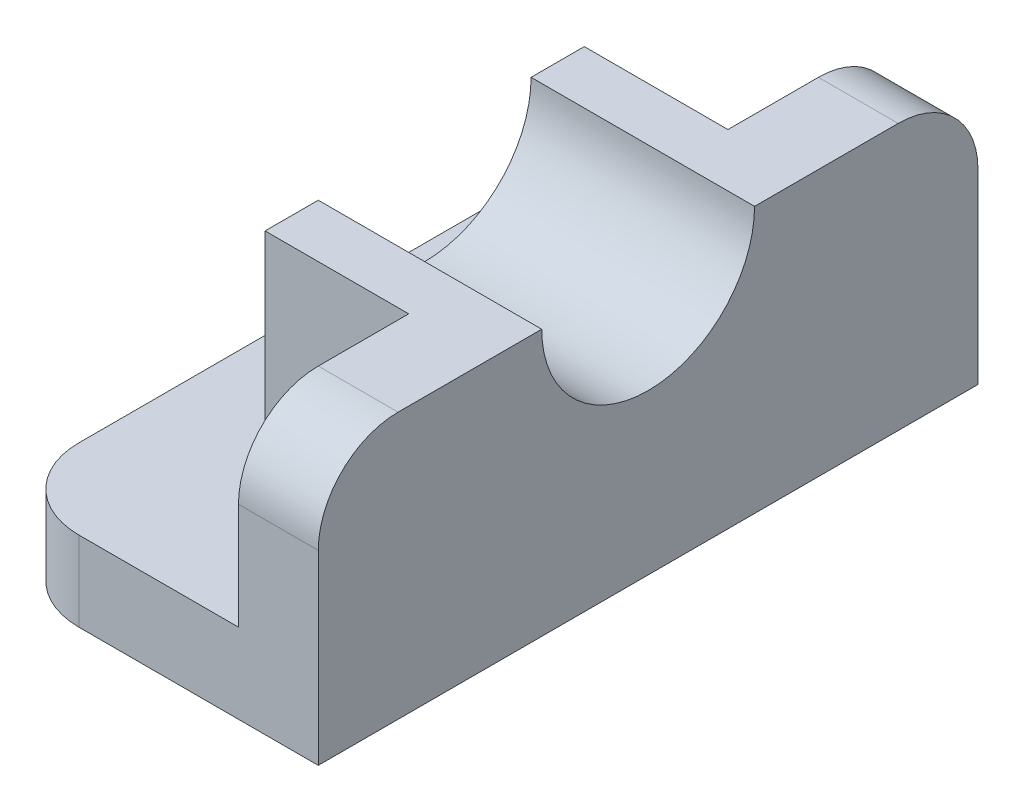
ISO-10303-21;
HEADER;
FILE_DESCRIPTION(('STEP AP214'),'2;1');
FILE_NAME('part.step','',(''),(''),'','','');
FILE_SCHEMA(('AUTOMOTIVE_DESIGN { 1 0 10303 214 1 1 1 1 }'));
ENDSEC;
DATA;
#1=APPLICATION_CONTEXT('core data for automotive mechanical design processes');
#2=APPLICATION_PROTOCOL_DEFINITION('international standard','automotive_design',2000,#1);
#3=PRODUCT_CONTEXT('',#1,'mechanical');
#4=PRODUCT('Part','Part','',(#3));
#5=PRODUCT_RELATED_PRODUCT_CATEGORY('part','',(#4));
#6=PRODUCT_DEFINITION_FORMATION('','',#4);
#7=PRODUCT_DEFINITION_CONTEXT('part definition',#1,'design');
#8=PRODUCT_DEFINITION('design','',#6,#7);
#9=PRODUCT_DEFINITION_SHAPE('','',#8);
#10=(LENGTH_UNIT() NAMED_UNIT(*) SI_UNIT(.MILLI.,.METRE.));
#11=(NAMED_UNIT(*) PLANE_ANGLE_UNIT() SI_UNIT($,.RADIAN.));
#12=(NAMED_UNIT(*) SI_UNIT($,.STERADIAN.) SOLID_ANGLE_UNIT());
#13=UNCERTAINTY_MEASURE_WITH_UNIT(LENGTH_MEASURE(1.E-05),#10,'distance_accuracy_value','');
#14=(GEOMETRIC_REPRESENTATION_CONTEXT(3) GLOBAL_UNCERTAINTY_ASSIGNED_CONTEXT((#13)) GLOBAL_UNIT_ASSIGNED_CONTEXT((#10,
#11,#12)) REPRESENTATION_CONTEXT('',''));
#15=CARTESIAN_POINT('',(0.,0.,0.));
#16=DIRECTION('',(0.,0.,1.));
#17=DIRECTION('',(1.,0.,0.));
#18=AXIS2_PLACEMENT_3D('',#15,#16,#17);
#19=CARTESIAN_POINT('',(60.,50.,124.));
#20=DIRECTION('',(0.,-1.,0.));
#21=DIRECTION('',(1.,0.,0.));
#22=AXIS2_PLACEMENT_3D('',#19,#20,#21);
#23=PLANE('',#22);
#24=DIRECTION('',(0.,0.,-1.));
#25=VECTOR('',#24,1.);
#26=CARTESIAN_POINT('',(60.,50.,124.));
#27=LINE('',#26,#25);
#28=CARTESIAN_POINT('',(60.,50.,109.));
#29=VERTEX_POINT('',#28);
#30=CARTESIAN_POINT('',(60.,50.,82.));
#31=VERTEX_POINT('',#30);
#32=EDGE_CURVE('E167',#29,#31,#27,.T.);
#33=ORIENTED_EDGE('',*,*,#32,.T.);
#34=DIRECTION('',(-1.,0.,0.));
#35=VECTOR('',#34,1.);
#36=CARTESIAN_POINT('',(68.,50.,82.));
#37=LINE('',#36,#35);
#38=CARTESIAN_POINT('',(18.,50.,82.));
#39=VERTEX_POINT('',#38);
#40=EDGE_CURVE('E156',#31,#39,#37,.T.);
#41=ORIENTED_EDGE('',*,*,#40,.T.);
#42=DIRECTION('',(0.,0.,-1.));
#43=VECTOR('',#42,1.);
#44=CARTESIAN_POINT('',(18.,50.,32.));
#45=LINE('',#44,#43);
#46=CARTESIAN_POINT('',(18.,50.,92.));
#47=VERTEX_POINT('',#46);
#48=EDGE_CURVE('E165',#47,#39,#45,.T.);
#49=ORIENTED_EDGE('',*,*,#48,.F.);
#50=DIRECTION('',(1.,0.,0.));
#51=VECTOR('',#50,1.);
#52=CARTESIAN_POINT('',(18.,50.,92.));
#53=LINE('',#52,#51);
#54=CARTESIAN_POINT('',(45.,50.,92.));
#55=VERTEX_POINT('',#54);
#56=EDGE_CURVE('E182',#47,#55,#53,.T.);
#57=ORIENTED_EDGE('',*,*,#56,.T.);
#58=DIRECTION('',(0.,0.,-1.));
#59=VECTOR('',#58,1.);
#60=CARTESIAN_POINT('',(45.,50.,124.));
#61=LINE('',#60,#59);
#62=CARTESIAN_POINT('',(45.,50.,109.));
#63=VERTEX_POINT('',#62);
#64=EDGE_CURVE('E239',#63,#55,#61,.T.);
#65=ORIENTED_EDGE('',*,*,#64,.F.);
#66=DIRECTION('',(-1.,0.,0.));
#67=VECTOR('',#66,1.);
#68=CARTESIAN_POINT('',(60.,50.,109.));
#69=LINE('',#68,#67);
#70=EDGE_CURVE('E254',#63,#29,#69,.F.);
#71=ORIENTED_EDGE('',*,*,#70,.T.);
#72=EDGE_LOOP('',(#33,#41,#49,#57,#65,#71));
#73=FACE_BOUND('',#72,.T.);
#74=ADVANCED_FACE('F43',(#73),#23,.F.);
#75=CARTESIAN_POINT('',(45.,50.,124.));
#76=DIRECTION('',(1.,0.,0.));
#77=DIRECTION('',(0.,0.,-1.));
#78=AXIS2_PLACEMENT_3D('',#75,#76,#77);
#79=PLANE('',#78);
#80=DIRECTION('',(0.,-1.,0.));
#81=VECTOR('',#80,1.);
#82=CARTESIAN_POINT('',(45.,50.,32.));
#83=LINE('',#82,#81);
#84=CARTESIAN_POINT('',(45.,50.,32.));
#85=VERTEX_POINT('',#84);
#86=CARTESIAN_POINT('',(45.,15.,32.));
#87=VERTEX_POINT('',#86);
#88=EDGE_CURVE('E169',#85,#87,#83,.T.);
#89=ORIENTED_EDGE('',*,*,#88,.F.);
#90=CARTESIAN_POINT('',(45.,50.,15.));
#91=VERTEX_POINT('',#90);
#92=EDGE_CURVE('E238',#85,#91,#61,.T.);
#93=ORIENTED_EDGE('',*,*,#92,.T.);
#94=CARTESIAN_POINT('',(45.,35.,15.));
#95=DIRECTION('',(1.,0.,0.));
#96=DIRECTION('',(0.,0.,-1.));
#97=AXIS2_PLACEMENT_3D('',#94,#95,#96);
#98=CIRCLE('',#97,15.);
#99=CARTESIAN_POINT('',(45.,35.,0.));
#100=VERTEX_POINT('',#99);
#101=EDGE_CURVE('E264',#91,#100,#98,.F.);
#102=ORIENTED_EDGE('',*,*,#101,.T.);
#103=DIRECTION('',(0.,-1.,0.));
#104=VECTOR('',#103,1.);
#105=CARTESIAN_POINT('',(45.,50.,0.));
#106=LINE('',#105,#104);
#107=CARTESIAN_POINT('',(45.,15.,0.));
#108=VERTEX_POINT('',#107);
#109=EDGE_CURVE('E223',#100,#108,#106,.T.);
#110=ORIENTED_EDGE('',*,*,#109,.T.);
#111=DIRECTION('',(0.,0.,-1.));
#112=VECTOR('',#111,1.);
#113=CARTESIAN_POINT('',(45.,15.,124.));
#114=LINE('',#113,#112);
#115=EDGE_CURVE('E233',#87,#108,#114,.T.);
#116=ORIENTED_EDGE('',*,*,#115,.F.);
#117=EDGE_LOOP('',(#89,#93,#102,#110,#116));
#118=FACE_BOUND('',#117,.T.);
#119=ADVANCED_FACE('F346',(#118),#79,.F.);
#120=DIRECTION('',(0.,1.,0.));
#121=VECTOR('',#120,1.);
#122=CARTESIAN_POINT('',(45.,50.,92.));
#123=LINE('',#122,#121);
#124=CARTESIAN_POINT('',(45.,15.,92.));
#125=VERTEX_POINT('',#124);
#126=EDGE_CURVE('E189',#125,#55,#123,.T.);
#127=ORIENTED_EDGE('',*,*,#126,.F.);
#128=CARTESIAN_POINT('',(45.,15.,124.));
#129=VERTEX_POINT('',#128);
#130=EDGE_CURVE('E234',#129,#125,#114,.T.);
#131=ORIENTED_EDGE('',*,*,#130,.F.);
#132=DIRECTION('',(0.,-1.,0.));
#133=VECTOR('',#132,1.);
#134=CARTESIAN_POINT('',(45.,50.,124.));
#135=LINE('',#134,#133);
#136=CARTESIAN_POINT('',(45.,35.,124.));
#137=VERTEX_POINT('',#136);
#138=EDGE_CURVE('E209',#137,#129,#135,.T.);
#139=ORIENTED_EDGE('',*,*,#138,.F.);
#140=CARTESIAN_POINT('',(45.,35.,109.));
#141=DIRECTION('',(1.,0.,0.));
#142=DIRECTION('',(0.,0.,-1.));
#143=AXIS2_PLACEMENT_3D('',#140,#141,#142);
#144=CIRCLE('',#143,15.);
#145=EDGE_CURVE('E261',#137,#63,#144,.F.);
#146=ORIENTED_EDGE('',*,*,#145,.T.);
#147=ORIENTED_EDGE('',*,*,#64,.T.);
#148=EDGE_LOOP('',(#127,#131,#139,#146,#147));
#149=FACE_BOUND('',#148,.T.);
#150=ADVANCED_FACE('F369',(#149),#79,.F.);
#151=CARTESIAN_POINT('',(45.,15.,124.));
#152=DIRECTION('',(0.,-1.,0.));
#153=DIRECTION('',(1.,0.,0.));
#154=AXIS2_PLACEMENT_3D('',#151,#152,#153);
#155=PLANE('',#154);
#156=DIRECTION('',(1.,0.,0.));
#157=VECTOR('',#156,1.);
#158=CARTESIAN_POINT('',(18.,15.,32.));
#159=LINE('',#158,#157);
#160=CARTESIAN_POINT('',(18.,15.,32.));
#161=VERTEX_POINT('',#160);
#162=EDGE_CURVE('E66',#161,#87,#159,.T.);
#163=ORIENTED_EDGE('',*,*,#162,.T.);
#164=ORIENTED_EDGE('',*,*,#115,.T.);
#165=DIRECTION('',(-1.,0.,0.));
#166=VECTOR('',#165,1.);
#167=CARTESIAN_POINT('',(45.,15.,0.));
#168=LINE('',#167,#166);
#169=CARTESIAN_POINT('',(15.,15.,0.));
#170=VERTEX_POINT('',#169);
#171=EDGE_CURVE('E205',#108,#170,#168,.T.);
#172=ORIENTED_EDGE('',*,*,#171,.T.);
#173=CARTESIAN_POINT('',(15.,15.,15.));
#174=DIRECTION('',(0.,-1.,0.));
#175=DIRECTION('',(1.,0.,0.));
#176=AXIS2_PLACEMENT_3D('',#173,#174,#175);
#177=CIRCLE('',#176,15.);
#178=CARTESIAN_POINT('',(0.,15.,15.));
#179=VERTEX_POINT('',#178);
#180=EDGE_CURVE('E52',#170,#179,#177,.F.);
#181=ORIENTED_EDGE('',*,*,#180,.T.);
#182=DIRECTION('',(0.,0.,-1.));
#183=VECTOR('',#182,1.);
#184=CARTESIAN_POINT('',(0.,15.,124.));
#185=LINE('',#184,#183);
#186=CARTESIAN_POINT('',(0.,15.,109.));
#187=VERTEX_POINT('',#186);
#188=EDGE_CURVE('E216',#187,#179,#185,.T.);
#189=ORIENTED_EDGE('',*,*,#188,.F.);
#190=CARTESIAN_POINT('',(15.,15.,109.));
#191=DIRECTION('',(0.,-1.,0.));
#192=DIRECTION('',(1.,0.,0.));
#193=AXIS2_PLACEMENT_3D('',#190,#191,#192);
#194=CIRCLE('',#193,15.);
#195=CARTESIAN_POINT('',(15.,15.,124.));
#196=VERTEX_POINT('',#195);
#197=EDGE_CURVE('E291',#187,#196,#194,.F.);
#198=ORIENTED_EDGE('',*,*,#197,.T.);
#199=DIRECTION('',(-1.,0.,0.));
#200=VECTOR('',#199,1.);
#201=CARTESIAN_POINT('',(45.,15.,124.));
#202=LINE('',#201,#200);
#203=EDGE_CURVE('E212',#129,#196,#202,.T.);
#204=ORIENTED_EDGE('',*,*,#203,.F.);
#205=ORIENTED_EDGE('',*,*,#130,.T.);
#206=DIRECTION('',(1.,0.,0.));
#207=VECTOR('',#206,1.);
#208=CARTESIAN_POINT('',(18.,15.,92.));
#209=LINE('',#208,#207);
#210=CARTESIAN_POINT('',(18.,15.,92.));
#211=VERTEX_POINT('',#210);
#212=EDGE_CURVE('E195',#211,#125,#209,.T.);
#213=ORIENTED_EDGE('',*,*,#212,.F.);
#214=DIRECTION('',(0.,0.,1.));
#215=VECTOR('',#214,1.);
#216=CARTESIAN_POINT('',(18.,15.,32.));
#217=LINE('',#216,#215);
#218=EDGE_CURVE('E348',#161,#211,#217,.T.);
#219=ORIENTED_EDGE('',*,*,#218,.F.);
#220=EDGE_LOOP('',(#163,#164,#172,#181,#189,#198,#204,#205,#213,#219));
#221=FACE_BOUND('',#220,.T.);
#222=ADVANCED_FACE('F307',(#221),#155,.F.);
#223=CARTESIAN_POINT('',(0.,15.,124.));
#224=DIRECTION('',(1.,0.,0.));
#225=DIRECTION('',(0.,1.,0.));
#226=AXIS2_PLACEMENT_3D('',#223,#224,#225);
#227=PLANE('',#226);
#228=ORIENTED_EDGE('',*,*,#188,.T.);
#229=DIRECTION('',(0.,-1.,0.));
#230=VECTOR('',#229,1.);
#231=CARTESIAN_POINT('',(0.,15.,15.));
#232=LINE('',#231,#230);
#233=CARTESIAN_POINT('',(0.,0.,15.));
#234=VERTEX_POINT('',#233);
#235=EDGE_CURVE('E294',#179,#234,#232,.T.);
#236=ORIENTED_EDGE('',*,*,#235,.T.);
#237=DIRECTION('',(0.,0.,-1.));
#238=VECTOR('',#237,1.);
#239=CARTESIAN_POINT('',(0.,0.,124.));
#240=LINE('',#239,#238);
#241=CARTESIAN_POINT('',(0.,0.,109.));
#242=VERTEX_POINT('',#241);
#243=EDGE_CURVE('E250',#242,#234,#240,.T.);
#244=ORIENTED_EDGE('',*,*,#243,.F.);
#245=DIRECTION('',(0.,-1.,0.));
#246=VECTOR('',#245,1.);
#247=CARTESIAN_POINT('',(0.,15.,109.));
#248=LINE('',#247,#246);
#249=EDGE_CURVE('E288',#242,#187,#248,.F.);
#250=ORIENTED_EDGE('',*,*,#249,.T.);
#251=EDGE_LOOP('',(#228,#236,#244,#250));
#252=FACE_BOUND('',#251,.T.);
#253=ADVANCED_FACE('F314',(#252),#227,.F.);
#254=CARTESIAN_POINT('',(0.,0.,124.));
#255=DIRECTION('',(0.,1.,0.));
#256=DIRECTION('',(0.,0.,1.));
#257=AXIS2_PLACEMENT_3D('',#254,#255,#256);
#258=PLANE('',#257);
#259=ORIENTED_EDGE('',*,*,#243,.T.);
#260=CARTESIAN_POINT('',(15.,0.,15.));
#261=DIRECTION('',(0.,1.,0.));
#262=DIRECTION('',(0.,0.,1.));
#263=AXIS2_PLACEMENT_3D('',#260,#261,#262);
#264=CIRCLE('',#263,15.);
#265=CARTESIAN_POINT('',(15.,0.,0.));
#266=VERTEX_POINT('',#265);
#267=EDGE_CURVE('E298',#234,#266,#264,.F.);
#268=ORIENTED_EDGE('',*,*,#267,.T.);
#269=DIRECTION('',(1.,0.,0.));
#270=VECTOR('',#269,1.);
#271=CARTESIAN_POINT('',(0.,0.,0.));
#272=LINE('',#271,#270);
#273=CARTESIAN_POINT('',(60.,0.,0.));
#274=VERTEX_POINT('',#273);
#275=EDGE_CURVE('E200',#266,#274,#272,.T.);
#276=ORIENTED_EDGE('',*,*,#275,.T.);
#277=DIRECTION('',(0.,0.,-1.));
#278=VECTOR('',#277,1.);
#279=CARTESIAN_POINT('',(60.,0.,124.));
#280=LINE('',#279,#278);
#281=CARTESIAN_POINT('',(60.,0.,124.));
#282=VERTEX_POINT('',#281);
#283=EDGE_CURVE('E246',#282,#274,#280,.T.);
#284=ORIENTED_EDGE('',*,*,#283,.F.);
#285=DIRECTION('',(1.,0.,0.));
#286=VECTOR('',#285,1.);
#287=CARTESIAN_POINT('',(0.,0.,124.));
#288=LINE('',#287,#286);
#289=CARTESIAN_POINT('',(15.,0.,124.));
#290=VERTEX_POINT('',#289);
#291=EDGE_CURVE('E201',#290,#282,#288,.T.);
#292=ORIENTED_EDGE('',*,*,#291,.F.);
#293=CARTESIAN_POINT('',(15.,0.,109.));
#294=DIRECTION('',(0.,1.,0.));
#295=DIRECTION('',(0.,0.,1.));
#296=AXIS2_PLACEMENT_3D('',#293,#294,#295);
#297=CIRCLE('',#296,15.);
#298=EDGE_CURVE('E285',#290,#242,#297,.F.);
#299=ORIENTED_EDGE('',*,*,#298,.T.);
#300=EDGE_LOOP('',(#259,#268,#276,#284,#292,#299));
#301=FACE_BOUND('',#300,.T.);
#302=ADVANCED_FACE('F319',(#301),#258,.F.);
#303=CARTESIAN_POINT('',(60.,0.,124.));
#304=DIRECTION('',(-1.,0.,0.));
#305=DIRECTION('',(0.,0.,1.));
#306=AXIS2_PLACEMENT_3D('',#303,#304,#305);
#307=PLANE('',#306);
#308=CARTESIAN_POINT('',(60.,50.,42.));
#309=VERTEX_POINT('',#308);
#310=CARTESIAN_POINT('',(60.,50.,15.));
#311=VERTEX_POINT('',#310);
#312=EDGE_CURVE('E243',#309,#311,#27,.T.);
#313=ORIENTED_EDGE('',*,*,#312,.F.);
#314=CARTESIAN_POINT('',(60.,50.,62.));
#315=DIRECTION('',(-1.,0.,0.));
#316=DIRECTION('',(0.,0.,1.));
#317=AXIS2_PLACEMENT_3D('',#314,#315,#316);
#318=CIRCLE('',#317,20.);
#319=EDGE_CURVE('E170',#309,#31,#318,.T.);
#320=ORIENTED_EDGE('',*,*,#319,.T.);
#321=ORIENTED_EDGE('',*,*,#32,.F.);
#322=CARTESIAN_POINT('',(60.,35.,109.));
#323=DIRECTION('',(-1.,0.,0.));
#324=DIRECTION('',(0.,0.,1.));
#325=AXIS2_PLACEMENT_3D('',#322,#323,#324);
#326=CIRCLE('',#325,15.);
#327=CARTESIAN_POINT('',(60.,35.,124.));
#328=VERTEX_POINT('',#327);
#329=EDGE_CURVE('E270',#29,#328,#326,.F.);
#330=ORIENTED_EDGE('',*,*,#329,.T.);
#331=DIRECTION('',(0.,1.,0.));
#332=VECTOR('',#331,1.);
#333=CARTESIAN_POINT('',(60.,0.,124.));
#334=LINE('',#333,#332);
#335=EDGE_CURVE('E204',#282,#328,#334,.T.);
#336=ORIENTED_EDGE('',*,*,#335,.F.);
#337=ORIENTED_EDGE('',*,*,#283,.T.);
#338=DIRECTION('',(0.,1.,0.));
#339=VECTOR('',#338,1.);
#340=CARTESIAN_POINT('',(60.,0.,0.));
#341=LINE('',#340,#339);
#342=CARTESIAN_POINT('',(60.,35.,0.));
#343=VERTEX_POINT('',#342);
#344=EDGE_CURVE('E219',#274,#343,#341,.T.);
#345=ORIENTED_EDGE('',*,*,#344,.T.);
#346=CARTESIAN_POINT('',(60.,35.,15.));
#347=DIRECTION('',(-1.,0.,0.));
#348=DIRECTION('',(0.,0.,1.));
#349=AXIS2_PLACEMENT_3D('',#346,#347,#348);
#350=CIRCLE('',#349,15.);
#351=EDGE_CURVE('E273',#343,#311,#350,.F.);
#352=ORIENTED_EDGE('',*,*,#351,.T.);
#353=EDGE_LOOP('',(#313,#320,#321,#330,#336,#337,#345,#352));
#354=FACE_BOUND('',#353,.T.);
#355=ADVANCED_FACE('F329',(#354),#307,.F.);
#356=CARTESIAN_POINT('',(18.,50.,42.));
#357=VERTEX_POINT('',#356);
#358=CARTESIAN_POINT('',(18.,50.,32.));
#359=VERTEX_POINT('',#358);
#360=EDGE_CURVE('E178',#357,#359,#45,.T.);
#361=ORIENTED_EDGE('',*,*,#360,.F.);
#362=DIRECTION('',(-1.,0.,0.));
#363=VECTOR('',#362,1.);
#364=CARTESIAN_POINT('',(68.,50.,42.));
#365=LINE('',#364,#363);
#366=EDGE_CURVE('E58',#357,#309,#365,.F.);
#367=ORIENTED_EDGE('',*,*,#366,.T.);
#368=ORIENTED_EDGE('',*,*,#312,.T.);
#369=DIRECTION('',(-1.,0.,0.));
#370=VECTOR('',#369,1.);
#371=CARTESIAN_POINT('',(60.,50.,15.));
#372=LINE('',#371,#370);
#373=EDGE_CURVE('E257',#311,#91,#372,.T.);
#374=ORIENTED_EDGE('',*,*,#373,.T.);
#375=ORIENTED_EDGE('',*,*,#92,.F.);
#376=DIRECTION('',(1.,0.,0.));
#377=VECTOR('',#376,1.);
#378=CARTESIAN_POINT('',(18.,50.,32.));
#379=LINE('',#378,#377);
#380=EDGE_CURVE('E177',#359,#85,#379,.T.);
#381=ORIENTED_EDGE('',*,*,#380,.F.);
#382=EDGE_LOOP('',(#361,#367,#368,#374,#375,#381));
#383=FACE_BOUND('',#382,.T.);
#384=ADVANCED_FACE('F337',(#383),#23,.F.);
#385=CARTESIAN_POINT('',(0.,0.,124.));
#386=DIRECTION('',(0.,0.,1.));
#387=DIRECTION('',(1.,0.,0.));
#388=AXIS2_PLACEMENT_3D('',#385,#386,#387);
#389=PLANE('',#388);
#390=ORIENTED_EDGE('',*,*,#203,.T.);
#391=DIRECTION('',(0.,-1.,0.));
#392=VECTOR('',#391,1.);
#393=CARTESIAN_POINT('',(15.,0.,124.));
#394=LINE('',#393,#392);
#395=EDGE_CURVE('E281',#196,#290,#394,.T.);
#396=ORIENTED_EDGE('',*,*,#395,.T.);
#397=ORIENTED_EDGE('',*,*,#291,.T.);
#398=ORIENTED_EDGE('',*,*,#335,.T.);
#399=DIRECTION('',(-1.,0.,0.));
#400=VECTOR('',#399,1.);
#401=CARTESIAN_POINT('',(45.,35.,124.));
#402=LINE('',#401,#400);
#403=EDGE_CURVE('E277',#328,#137,#402,.T.);
#404=ORIENTED_EDGE('',*,*,#403,.T.);
#405=ORIENTED_EDGE('',*,*,#138,.T.);
#406=EDGE_LOOP('',(#390,#396,#397,#398,#404,#405));
#407=FACE_BOUND('',#406,.T.);
#408=ADVANCED_FACE('F365',(#407),#389,.T.);
#409=CARTESIAN_POINT('',(0.,0.,0.));
#410=DIRECTION('',(0.,0.,1.));
#411=DIRECTION('',(1.,0.,0.));
#412=AXIS2_PLACEMENT_3D('',#409,#410,#411);
#413=PLANE('',#412);
#414=ORIENTED_EDGE('',*,*,#275,.F.);
#415=DIRECTION('',(0.,-1.,0.));
#416=VECTOR('',#415,1.);
#417=CARTESIAN_POINT('',(15.,0.,0.));
#418=LINE('',#417,#416);
#419=EDGE_CURVE('E301',#266,#170,#418,.F.);
#420=ORIENTED_EDGE('',*,*,#419,.T.);
#421=ORIENTED_EDGE('',*,*,#171,.F.);
#422=ORIENTED_EDGE('',*,*,#109,.F.);
#423=DIRECTION('',(-1.,0.,0.));
#424=VECTOR('',#423,1.);
#425=CARTESIAN_POINT('',(0.,35.,0.));
#426=LINE('',#425,#424);
#427=EDGE_CURVE('E267',#100,#343,#426,.F.);
#428=ORIENTED_EDGE('',*,*,#427,.T.);
#429=ORIENTED_EDGE('',*,*,#344,.F.);
#430=EDGE_LOOP('',(#414,#420,#421,#422,#428,#429));
#431=FACE_BOUND('',#430,.T.);
#432=ADVANCED_FACE('F323',(#431),#413,.F.);
#433=CARTESIAN_POINT('',(60.,35.,15.));
#434=DIRECTION('',(-1.,0.,0.));
#435=DIRECTION('',(0.,-1.,0.));
#436=AXIS2_PLACEMENT_3D('',#433,#434,#435);
#437=CYLINDRICAL_SURFACE('',#436,15.);
#438=ORIENTED_EDGE('',*,*,#351,.F.);
#439=ORIENTED_EDGE('',*,*,#427,.F.);
#440=ORIENTED_EDGE('',*,*,#101,.F.);
#441=ORIENTED_EDGE('',*,*,#373,.F.);
#442=EDGE_LOOP('',(#438,#439,#440,#441));
#443=FACE_BOUND('',#442,.T.);
#444=ADVANCED_FACE('F333',(#443),#437,.T.);
#445=CARTESIAN_POINT('',(15.,0.,109.));
#446=DIRECTION('',(0.,1.,0.));
#447=DIRECTION('',(-1.,0.,0.));
#448=AXIS2_PLACEMENT_3D('',#445,#446,#447);
#449=CYLINDRICAL_SURFACE('',#448,15.);
#450=ORIENTED_EDGE('',*,*,#197,.F.);
#451=ORIENTED_EDGE('',*,*,#249,.F.);
#452=ORIENTED_EDGE('',*,*,#298,.F.);
#453=ORIENTED_EDGE('',*,*,#395,.F.);
#454=EDGE_LOOP('',(#450,#451,#452,#453));
#455=FACE_BOUND('',#454,.T.);
#456=ADVANCED_FACE('F375',(#455),#449,.T.);
#457=CARTESIAN_POINT('',(0.,35.,109.));
#458=DIRECTION('',(1.,0.,0.));
#459=DIRECTION('',(0.,1.,0.));
#460=AXIS2_PLACEMENT_3D('',#457,#458,#459);
#461=CYLINDRICAL_SURFACE('',#460,15.);
#462=ORIENTED_EDGE('',*,*,#329,.F.);
#463=ORIENTED_EDGE('',*,*,#70,.F.);
#464=ORIENTED_EDGE('',*,*,#145,.F.);
#465=ORIENTED_EDGE('',*,*,#403,.F.);
#466=EDGE_LOOP('',(#462,#463,#464,#465));
#467=FACE_BOUND('',#466,.T.);
#468=ADVANCED_FACE('F362',(#467),#461,.T.);
#469=CARTESIAN_POINT('',(15.,15.,15.));
#470=DIRECTION('',(0.,-1.,0.));
#471=DIRECTION('',(1.,0.,0.));
#472=AXIS2_PLACEMENT_3D('',#469,#470,#471);
#473=CYLINDRICAL_SURFACE('',#472,15.);
#474=ORIENTED_EDGE('',*,*,#180,.F.);
#475=ORIENTED_EDGE('',*,*,#419,.F.);
#476=ORIENTED_EDGE('',*,*,#267,.F.);
#477=ORIENTED_EDGE('',*,*,#235,.F.);
#478=EDGE_LOOP('',(#474,#475,#476,#477));
#479=FACE_BOUND('',#478,.T.);
#480=ADVANCED_FACE('F45',(#479),#473,.T.);
#481=CARTESIAN_POINT('',(18.,50.,32.));
#482=DIRECTION('',(0.,0.,1.));
#483=DIRECTION('',(0.,-1.,0.));
#484=AXIS2_PLACEMENT_3D('',#481,#482,#483);
#485=PLANE('',#484);
#486=ORIENTED_EDGE('',*,*,#88,.T.);
#487=ORIENTED_EDGE('',*,*,#162,.F.);
#488=DIRECTION('',(0.,-1.,0.));
#489=VECTOR('',#488,1.);
#490=CARTESIAN_POINT('',(18.,50.,32.));
#491=LINE('',#490,#489);
#492=EDGE_CURVE('E191',#359,#161,#491,.T.);
#493=ORIENTED_EDGE('',*,*,#492,.F.);
#494=ORIENTED_EDGE('',*,*,#380,.T.);
#495=EDGE_LOOP('',(#486,#487,#493,#494));
#496=FACE_BOUND('',#495,.T.);
#497=ADVANCED_FACE('F347',(#496),#485,.F.);
#498=CARTESIAN_POINT('',(18.,50.,92.));
#499=DIRECTION('',(0.,0.,-1.));
#500=DIRECTION('',(0.,1.,0.));
#501=AXIS2_PLACEMENT_3D('',#498,#499,#500);
#502=PLANE('',#501);
#503=ORIENTED_EDGE('',*,*,#126,.T.);
#504=ORIENTED_EDGE('',*,*,#56,.F.);
#505=DIRECTION('',(0.,1.,0.));
#506=VECTOR('',#505,1.);
#507=CARTESIAN_POINT('',(18.,50.,92.));
#508=LINE('',#507,#506);
#509=EDGE_CURVE('E174',#211,#47,#508,.T.);
#510=ORIENTED_EDGE('',*,*,#509,.F.);
#511=ORIENTED_EDGE('',*,*,#212,.T.);
#512=EDGE_LOOP('',(#503,#504,#510,#511));
#513=FACE_BOUND('',#512,.T.);
#514=ADVANCED_FACE('F414',(#513),#502,.F.);
#515=CARTESIAN_POINT('',(18.,0.,0.));
#516=DIRECTION('',(-1.,0.,0.));
#517=DIRECTION('',(0.,0.,1.));
#518=AXIS2_PLACEMENT_3D('',#515,#516,#517);
#519=PLANE('',#518);
#520=CARTESIAN_POINT('',(18.,50.,62.));
#521=DIRECTION('',(-1.,0.,0.));
#522=DIRECTION('',(0.,0.,1.));
#523=AXIS2_PLACEMENT_3D('',#520,#521,#522);
#524=CIRCLE('',#523,20.);
#525=EDGE_CURVE('E11',#357,#39,#524,.T.);
#526=ORIENTED_EDGE('',*,*,#525,.F.);
#527=ORIENTED_EDGE('',*,*,#360,.T.);
#528=ORIENTED_EDGE('',*,*,#492,.T.);
#529=ORIENTED_EDGE('',*,*,#218,.T.);
#530=ORIENTED_EDGE('',*,*,#509,.T.);
#531=ORIENTED_EDGE('',*,*,#48,.T.);
#532=EDGE_LOOP('',(#526,#527,#528,#529,#530,#531));
#533=FACE_BOUND('',#532,.T.);
#534=ADVANCED_FACE('F172',(#533),#519,.T.);
#535=CARTESIAN_POINT('',(68.,50.,62.));
#536=DIRECTION('',(-1.,0.,0.));
#537=DIRECTION('',(0.,0.,1.));
#538=AXIS2_PLACEMENT_3D('',#535,#536,#537);
#539=CYLINDRICAL_SURFACE('',#538,20.);
#540=ORIENTED_EDGE('',*,*,#319,.F.);
#541=ORIENTED_EDGE('',*,*,#366,.F.);
#542=ORIENTED_EDGE('',*,*,#525,.T.);
#543=ORIENTED_EDGE('',*,*,#40,.F.);
#544=EDGE_LOOP('',(#540,#541,#542,#543));
#545=FACE_BOUND('',#544,.T.);
#546=ADVANCED_FACE('F155',(#545),#539,.F.);
#547=CLOSED_SHELL('',(#74,#119,#150,#222,#253,#302,#355,#384,#408,#432,#444,#456,#468,#480,#497,
#514,#534,#546));
#548=MANIFOLD_SOLID_BREP('B2',#547);
#549=ADVANCED_BREP_SHAPE_REPRESENTATION('',(#18,#548),#14);
#550=SHAPE_DEFINITION_REPRESENTATION(#9,#549);
ENDSEC;
END-ISO-10303-21;
